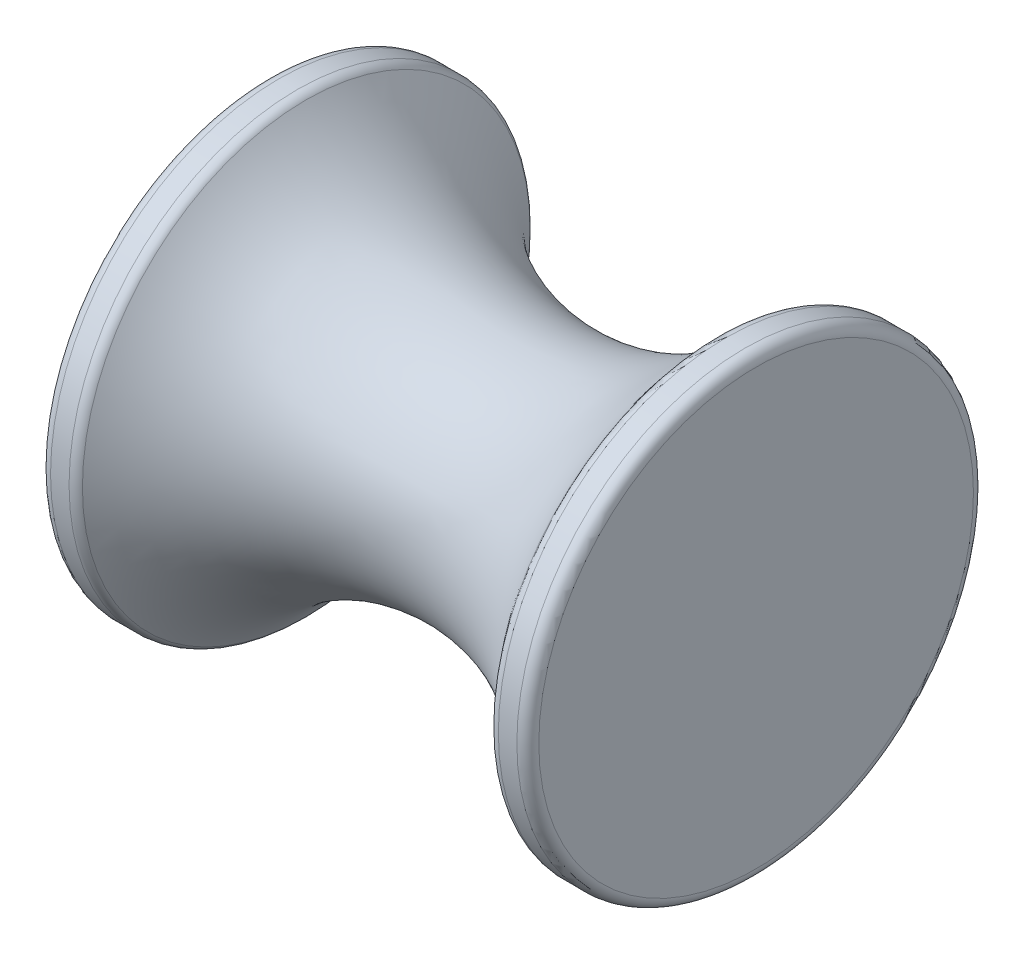
ISO-10303-21;
HEADER;
FILE_DESCRIPTION(('STEP AP214'),'2;1');
FILE_NAME('part.step','',(''),(''),'','','');
FILE_SCHEMA(('AUTOMOTIVE_DESIGN { 1 0 10303 214 1 1 1 1 }'));
ENDSEC;
DATA;
#1=APPLICATION_CONTEXT('core data for automotive mechanical design processes');
#2=APPLICATION_PROTOCOL_DEFINITION('international standard','automotive_design',2000,#1);
#3=PRODUCT_CONTEXT('',#1,'mechanical');
#4=PRODUCT('Part','Part','',(#3));
#5=PRODUCT_RELATED_PRODUCT_CATEGORY('part','',(#4));
#6=PRODUCT_DEFINITION_FORMATION('','',#4);
#7=PRODUCT_DEFINITION_CONTEXT('part definition',#1,'design');
#8=PRODUCT_DEFINITION('design','',#6,#7);
#9=PRODUCT_DEFINITION_SHAPE('','',#8);
#10=(LENGTH_UNIT() NAMED_UNIT(*) SI_UNIT(.MILLI.,.METRE.));
#11=(NAMED_UNIT(*) PLANE_ANGLE_UNIT() SI_UNIT($,.RADIAN.));
#12=(NAMED_UNIT(*) SI_UNIT($,.STERADIAN.) SOLID_ANGLE_UNIT());
#13=UNCERTAINTY_MEASURE_WITH_UNIT(LENGTH_MEASURE(1.E-05),#10,'distance_accuracy_value','');
#14=(GEOMETRIC_REPRESENTATION_CONTEXT(3) GLOBAL_UNCERTAINTY_ASSIGNED_CONTEXT((#13)) GLOBAL_UNIT_ASSIGNED_CONTEXT((#10,
#11,#12)) REPRESENTATION_CONTEXT('',''));
#15=CARTESIAN_POINT('',(0.,0.,0.));
#16=DIRECTION('',(0.,0.,1.));
#17=DIRECTION('',(1.,0.,0.));
#18=AXIS2_PLACEMENT_3D('',#15,#16,#17);
#19=CARTESIAN_POINT('',(-17.653,0.,0.));
#20=DIRECTION('',(-1.,0.,0.));
#21=DIRECTION('',(0.,0.,1.));
#22=AXIS2_PLACEMENT_3D('',#19,#20,#21);
#23=PLANE('',#22);
#24=CARTESIAN_POINT('',(-17.653,0.,0.));
#25=DIRECTION('',(-1.,0.,0.));
#26=DIRECTION('',(0.,0.,1.));
#27=AXIS2_PLACEMENT_3D('',#24,#25,#26);
#28=CIRCLE('',#27,15.71625);
#29=CARTESIAN_POINT('',(-17.653,0.,15.71625));
#30=VERTEX_POINT('',#29);
#31=EDGE_CURVE('E50',#30,#30,#28,.T.);
#32=ORIENTED_EDGE('',*,*,#31,.T.);
#33=EDGE_LOOP('',(#32));
#34=FACE_BOUND('',#33,.T.);
#35=ADVANCED_FACE('F37',(#34),#23,.T.);
#36=CARTESIAN_POINT('',(17.653,0.,0.));
#37=DIRECTION('',(-1.,0.,0.));
#38=DIRECTION('',(0.,0.,1.));
#39=AXIS2_PLACEMENT_3D('',#36,#37,#38);
#40=PLANE('',#39);
#41=CARTESIAN_POINT('',(17.653,0.,0.));
#42=DIRECTION('',(-1.,0.,0.));
#43=DIRECTION('',(0.,0.,1.));
#44=AXIS2_PLACEMENT_3D('',#41,#42,#43);
#45=CIRCLE('',#44,15.71625);
#46=CARTESIAN_POINT('',(17.653,0.,15.71625));
#47=VERTEX_POINT('',#46);
#48=EDGE_CURVE('E65',#47,#47,#45,.F.);
#49=ORIENTED_EDGE('',*,*,#48,.T.);
#50=EDGE_LOOP('',(#49));
#51=FACE_BOUND('',#50,.T.);
#52=ADVANCED_FACE('F102',(#51),#40,.F.);
#53=CARTESIAN_POINT('',(-17.653,0.,0.));
#54=DIRECTION('',(-1.,0.,0.));
#55=DIRECTION('',(0.,0.,1.));
#56=AXIS2_PLACEMENT_3D('',#53,#54,#55);
#57=CYLINDRICAL_SURFACE('',#56,16.51);
#58=CARTESIAN_POINT('',(16.85925,0.,0.));
#59=DIRECTION('',(-1.,0.,0.));
#60=DIRECTION('',(0.,0.,1.));
#61=AXIS2_PLACEMENT_3D('',#58,#59,#60);
#62=CIRCLE('',#61,16.51);
#63=CARTESIAN_POINT('',(16.85925,0.,16.51));
#64=VERTEX_POINT('',#63);
#65=EDGE_CURVE('E69',#64,#64,#62,.T.);
#66=ORIENTED_EDGE('',*,*,#65,.T.);
#67=EDGE_LOOP('',(#66));
#68=FACE_BOUND('',#67,.T.);
#69=CARTESIAN_POINT('',(15.5210419753314,0.,0.));
#70=DIRECTION('',(1.,0.,0.));
#71=DIRECTION('',(0.,0.,-1.));
#72=AXIS2_PLACEMENT_3D('',#69,#70,#71);
#73=CIRCLE('',#72,16.51);
#74=CARTESIAN_POINT('',(15.5210419753314,0.,-16.51));
#75=VERTEX_POINT('',#74);
#76=EDGE_CURVE('E73',#75,#75,#73,.T.);
#77=ORIENTED_EDGE('',*,*,#76,.T.);
#78=EDGE_LOOP('',(#77));
#79=FACE_BOUND('',#78,.T.);
#80=ADVANCED_FACE('F78',(#68,#79),#57,.T.);
#81=CARTESIAN_POINT('',(0.,0.,0.));
#82=DIRECTION('',(-1.,0.,0.));
#83=DIRECTION('',(0.,0.,1.));
#84=AXIS2_PLACEMENT_3D('',#81,#82,#83);
#85=TOROIDAL_SURFACE('',#84,27.0766048387097,18.4406048387097);
#86=CARTESIAN_POINT('',(14.8805303922174,0.,0.));
#87=DIRECTION('',(-1.,0.,0.));
#88=DIRECTION('',(0.,0.,1.));
#89=AXIS2_PLACEMENT_3D('',#86,#87,#88);
#90=CIRCLE('',#89,16.1850612353568);
#91=CARTESIAN_POINT('',(14.8805303922174,0.,16.1850612353568));
#92=VERTEX_POINT('',#91);
#93=EDGE_CURVE('E55',#92,#92,#90,.T.);
#94=ORIENTED_EDGE('',*,*,#93,.T.);
#95=EDGE_LOOP('',(#94));
#96=FACE_BOUND('',#95,.T.);
#97=CARTESIAN_POINT('',(-14.8805303922174,0.,0.));
#98=DIRECTION('',(1.,0.,0.));
#99=DIRECTION('',(0.,0.,-1.));
#100=AXIS2_PLACEMENT_3D('',#97,#98,#99);
#101=CIRCLE('',#100,16.1850612353568);
#102=CARTESIAN_POINT('',(-14.8805303922174,0.,-16.1850612353568));
#103=VERTEX_POINT('',#102);
#104=EDGE_CURVE('E61',#103,#103,#101,.T.);
#105=ORIENTED_EDGE('',*,*,#104,.T.);
#106=EDGE_LOOP('',(#105));
#107=FACE_BOUND('',#106,.T.);
#108=ADVANCED_FACE('F88',(#96,#107),#85,.F.);
#109=CARTESIAN_POINT('',(-17.653,0.,0.));
#110=DIRECTION('',(-1.,0.,0.));
#111=DIRECTION('',(0.,0.,1.));
#112=AXIS2_PLACEMENT_3D('',#109,#110,#111);
#113=CYLINDRICAL_SURFACE('',#112,16.51);
#114=CARTESIAN_POINT('',(-16.85925,0.,0.));
#115=DIRECTION('',(-1.,0.,0.));
#116=DIRECTION('',(0.,0.,1.));
#117=AXIS2_PLACEMENT_3D('',#114,#115,#116);
#118=CIRCLE('',#117,16.51);
#119=CARTESIAN_POINT('',(-16.85925,0.,16.51));
#120=VERTEX_POINT('',#119);
#121=EDGE_CURVE('E10',#120,#120,#118,.F.);
#122=ORIENTED_EDGE('',*,*,#121,.T.);
#123=EDGE_LOOP('',(#122));
#124=FACE_BOUND('',#123,.T.);
#125=CARTESIAN_POINT('',(-15.5210419753314,0.,0.));
#126=DIRECTION('',(1.,0.,0.));
#127=DIRECTION('',(0.,0.,-1.));
#128=AXIS2_PLACEMENT_3D('',#125,#126,#127);
#129=CIRCLE('',#128,16.51);
#130=CARTESIAN_POINT('',(-15.5210419753314,0.,-16.51));
#131=VERTEX_POINT('',#130);
#132=EDGE_CURVE('E45',#131,#131,#129,.F.);
#133=ORIENTED_EDGE('',*,*,#132,.T.);
#134=EDGE_LOOP('',(#133));
#135=FACE_BOUND('',#134,.T.);
#136=ADVANCED_FACE('F91',(#124,#135),#113,.T.);
#137=CARTESIAN_POINT('',(16.85925,0.,0.));
#138=DIRECTION('',(-1.,0.,0.));
#139=DIRECTION('',(0.,0.,1.));
#140=AXIS2_PLACEMENT_3D('',#137,#138,#139);
#141=TOROIDAL_SURFACE('',#140,15.71625,0.79375);
#142=ORIENTED_EDGE('',*,*,#48,.F.);
#143=EDGE_LOOP('',(#142));
#144=FACE_BOUND('',#143,.T.);
#145=ORIENTED_EDGE('',*,*,#65,.F.);
#146=EDGE_LOOP('',(#145));
#147=FACE_BOUND('',#146,.T.);
#148=ADVANCED_FACE('F84',(#144,#147),#141,.T.);
#149=CARTESIAN_POINT('',(15.5210419753314,0.,0.));
#150=DIRECTION('',(1.,0.,0.));
#151=DIRECTION('',(0.,0.,-1.));
#152=AXIS2_PLACEMENT_3D('',#149,#150,#151);
#153=TOROIDAL_SURFACE('',#152,15.71625,0.79375);
#154=ORIENTED_EDGE('',*,*,#76,.F.);
#155=EDGE_LOOP('',(#154));
#156=FACE_BOUND('',#155,.T.);
#157=ORIENTED_EDGE('',*,*,#93,.F.);
#158=EDGE_LOOP('',(#157));
#159=FACE_BOUND('',#158,.T.);
#160=ADVANCED_FACE('F80',(#156,#159),#153,.T.);
#161=CARTESIAN_POINT('',(-16.85925,0.,0.));
#162=DIRECTION('',(-1.,0.,0.));
#163=DIRECTION('',(0.,0.,1.));
#164=AXIS2_PLACEMENT_3D('',#161,#162,#163);
#165=TOROIDAL_SURFACE('',#164,15.71625,0.79375);
#166=ORIENTED_EDGE('',*,*,#121,.F.);
#167=EDGE_LOOP('',(#166));
#168=FACE_BOUND('',#167,.T.);
#169=ORIENTED_EDGE('',*,*,#31,.F.);
#170=EDGE_LOOP('',(#169));
#171=FACE_BOUND('',#170,.T.);
#172=ADVANCED_FACE('F83',(#168,#171),#165,.T.);
#173=CARTESIAN_POINT('',(-15.5210419753314,0.,0.));
#174=DIRECTION('',(1.,0.,0.));
#175=DIRECTION('',(0.,0.,-1.));
#176=AXIS2_PLACEMENT_3D('',#173,#174,#175);
#177=TOROIDAL_SURFACE('',#176,15.71625,0.79375);
#178=ORIENTED_EDGE('',*,*,#104,.F.);
#179=EDGE_LOOP('',(#178));
#180=FACE_BOUND('',#179,.T.);
#181=ORIENTED_EDGE('',*,*,#132,.F.);
#182=EDGE_LOOP('',(#181));
#183=FACE_BOUND('',#182,.T.);
#184=ADVANCED_FACE('F39',(#180,#183),#177,.T.);
#185=CLOSED_SHELL('',(#35,#52,#80,#108,#136,#148,#160,#172,#184));
#186=MANIFOLD_SOLID_BREP('B2',#185);
#187=ADVANCED_BREP_SHAPE_REPRESENTATION('',(#18,#186),#14);
#188=SHAPE_DEFINITION_REPRESENTATION(#9,#187);
ENDSEC;
END-ISO-10303-21;
